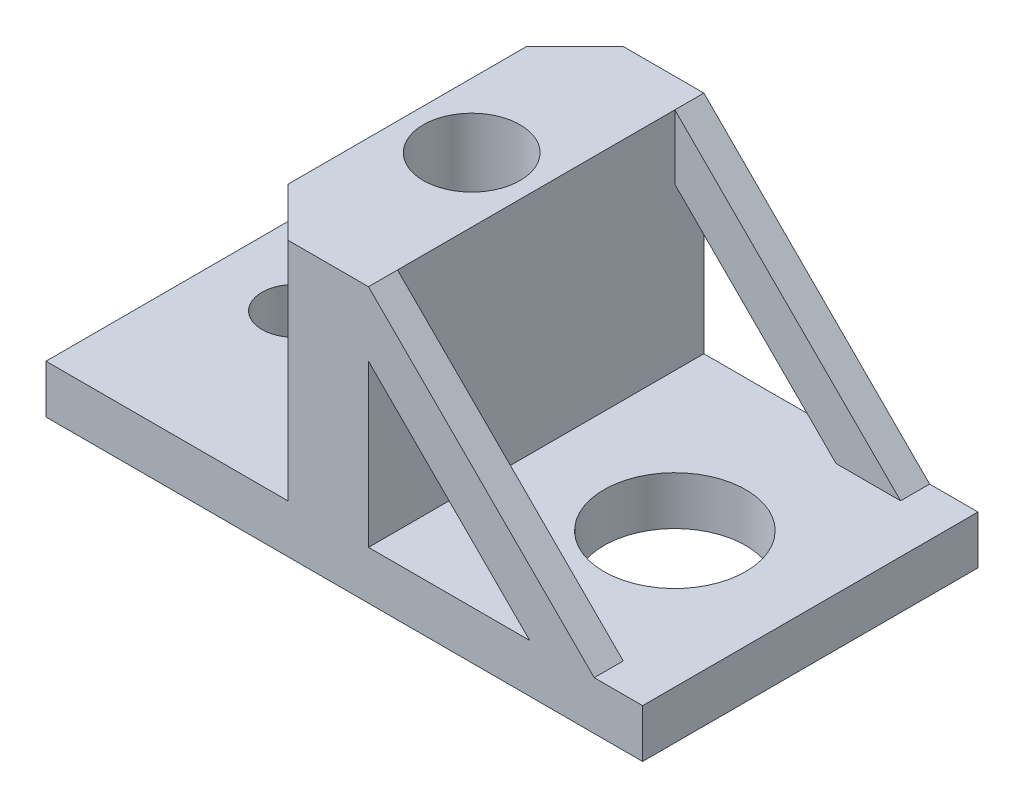
ISO-10303-21;
HEADER;
FILE_DESCRIPTION(('STEP AP214'),'2;1');
FILE_NAME('part.step','',(''),(''),'','','');
FILE_SCHEMA(('AUTOMOTIVE_DESIGN { 1 0 10303 214 1 1 1 1 }'));
ENDSEC;
DATA;
#1=APPLICATION_CONTEXT('core data for automotive mechanical design processes');
#2=APPLICATION_PROTOCOL_DEFINITION('international standard','automotive_design',2000,#1);
#3=PRODUCT_CONTEXT('',#1,'mechanical');
#4=PRODUCT('Part','Part','',(#3));
#5=PRODUCT_RELATED_PRODUCT_CATEGORY('part','',(#4));
#6=PRODUCT_DEFINITION_FORMATION('','',#4);
#7=PRODUCT_DEFINITION_CONTEXT('part definition',#1,'design');
#8=PRODUCT_DEFINITION('design','',#6,#7);
#9=PRODUCT_DEFINITION_SHAPE('','',#8);
#10=(LENGTH_UNIT() NAMED_UNIT(*) SI_UNIT(.MILLI.,.METRE.));
#11=(NAMED_UNIT(*) PLANE_ANGLE_UNIT() SI_UNIT($,.RADIAN.));
#12=(NAMED_UNIT(*) SI_UNIT($,.STERADIAN.) SOLID_ANGLE_UNIT());
#13=UNCERTAINTY_MEASURE_WITH_UNIT(LENGTH_MEASURE(1.E-05),#10,'distance_accuracy_value','');
#14=(GEOMETRIC_REPRESENTATION_CONTEXT(3) GLOBAL_UNCERTAINTY_ASSIGNED_CONTEXT((#13)) GLOBAL_UNIT_ASSIGNED_CONTEXT((#10,
#11,#12)) REPRESENTATION_CONTEXT('',''));
#15=CARTESIAN_POINT('',(0.,0.,0.));
#16=DIRECTION('',(0.,0.,1.));
#17=DIRECTION('',(1.,0.,0.));
#18=AXIS2_PLACEMENT_3D('',#15,#16,#17);
#19=CARTESIAN_POINT('',(0.,7.5,0.));
#20=DIRECTION('',(0.,-1.,0.));
#21=DIRECTION('',(0.,0.,-1.));
#22=AXIS2_PLACEMENT_3D('',#19,#20,#21);
#23=PLANE('',#22);
#24=CARTESIAN_POINT('',(71.5,7.5,-26.));
#25=DIRECTION('',(0.,1.,0.));
#26=DIRECTION('',(0.,0.,1.));
#27=AXIS2_PLACEMENT_3D('',#24,#25,#26);
#28=CIRCLE('',#27,11.);
#29=CARTESIAN_POINT('',(71.5,7.5,-15.));
#30=VERTEX_POINT('',#29);
#31=EDGE_CURVE('E227',#30,#30,#28,.T.);
#32=ORIENTED_EDGE('',*,*,#31,.F.);
#33=EDGE_LOOP('',(#32));
#34=FACE_BOUND('',#33,.T.);
#35=DIRECTION('',(-1.,0.,0.));
#36=VECTOR('',#35,1.);
#37=CARTESIAN_POINT('',(85.,7.5,-47.5));
#38=LINE('',#37,#36);
#39=CARTESIAN_POINT('',(85.,7.5,-47.5));
#40=VERTEX_POINT('',#39);
#41=CARTESIAN_POINT('',(75.,7.5,-47.5));
#42=VERTEX_POINT('',#41);
#43=EDGE_CURVE('E50',#40,#42,#38,.T.);
#44=ORIENTED_EDGE('',*,*,#43,.T.);
#45=DIRECTION('',(0.,0.,-1.));
#46=VECTOR('',#45,1.);
#47=CARTESIAN_POINT('',(75.,7.5,-47.5));
#48=LINE('',#47,#46);
#49=CARTESIAN_POINT('',(75.,7.5,-52.));
#50=VERTEX_POINT('',#49);
#51=EDGE_CURVE('E297',#42,#50,#48,.T.);
#52=ORIENTED_EDGE('',*,*,#51,.T.);
#53=DIRECTION('',(-1.,0.,0.));
#54=VECTOR('',#53,1.);
#55=CARTESIAN_POINT('',(0.,7.5,-52.));
#56=LINE('',#55,#54);
#57=CARTESIAN_POINT('',(50.,7.5,-52.));
#58=VERTEX_POINT('',#57);
#59=EDGE_CURVE('E257',#50,#58,#56,.T.);
#60=ORIENTED_EDGE('',*,*,#59,.T.);
#61=DIRECTION('',(0.,0.,-1.));
#62=VECTOR('',#61,1.);
#63=CARTESIAN_POINT('',(50.,7.5,0.));
#64=LINE('',#63,#62);
#65=CARTESIAN_POINT('',(50.,7.5,0.));
#66=VERTEX_POINT('',#65);
#67=EDGE_CURVE('E208',#66,#58,#64,.T.);
#68=ORIENTED_EDGE('',*,*,#67,.F.);
#69=DIRECTION('',(1.,0.,0.));
#70=VECTOR('',#69,1.);
#71=CARTESIAN_POINT('',(0.,7.5,0.));
#72=LINE('',#71,#70);
#73=CARTESIAN_POINT('',(75.,7.5,0.));
#74=VERTEX_POINT('',#73);
#75=EDGE_CURVE('E251',#66,#74,#72,.T.);
#76=ORIENTED_EDGE('',*,*,#75,.T.);
#77=DIRECTION('',(0.,0.,1.));
#78=VECTOR('',#77,1.);
#79=CARTESIAN_POINT('',(75.,7.5,-4.5));
#80=LINE('',#79,#78);
#81=CARTESIAN_POINT('',(75.,7.5,-4.5));
#82=VERTEX_POINT('',#81);
#83=EDGE_CURVE('E335',#82,#74,#80,.T.);
#84=ORIENTED_EDGE('',*,*,#83,.F.);
#85=DIRECTION('',(1.,0.,0.));
#86=VECTOR('',#85,1.);
#87=CARTESIAN_POINT('',(85.,7.5,-4.5));
#88=LINE('',#87,#86);
#89=CARTESIAN_POINT('',(85.,7.5,-4.5));
#90=VERTEX_POINT('',#89);
#91=EDGE_CURVE('E341',#82,#90,#88,.T.);
#92=ORIENTED_EDGE('',*,*,#91,.T.);
#93=DIRECTION('',(0.,0.,1.));
#94=VECTOR('',#93,1.);
#95=CARTESIAN_POINT('',(85.,7.5,-4.5));
#96=LINE('',#95,#94);
#97=CARTESIAN_POINT('',(85.,7.5,0.));
#98=VERTEX_POINT('',#97);
#99=EDGE_CURVE('E203',#90,#98,#96,.T.);
#100=ORIENTED_EDGE('',*,*,#99,.T.);
#101=CARTESIAN_POINT('',(92.5,7.5,0.));
#102=VERTEX_POINT('',#101);
#103=EDGE_CURVE('E245',#98,#102,#72,.T.);
#104=ORIENTED_EDGE('',*,*,#103,.T.);
#105=DIRECTION('',(0.,0.,-1.));
#106=VECTOR('',#105,1.);
#107=CARTESIAN_POINT('',(92.5,7.5,0.));
#108=LINE('',#107,#106);
#109=CARTESIAN_POINT('',(92.5,7.5,-52.));
#110=VERTEX_POINT('',#109);
#111=EDGE_CURVE('E250',#102,#110,#108,.T.);
#112=ORIENTED_EDGE('',*,*,#111,.T.);
#113=CARTESIAN_POINT('',(85.,7.5,-52.));
#114=VERTEX_POINT('',#113);
#115=EDGE_CURVE('E254',#110,#114,#56,.T.);
#116=ORIENTED_EDGE('',*,*,#115,.T.);
#117=DIRECTION('',(0.,0.,-1.));
#118=VECTOR('',#117,1.);
#119=CARTESIAN_POINT('',(85.,7.5,-47.5));
#120=LINE('',#119,#118);
#121=EDGE_CURVE('E55',#40,#114,#120,.T.);
#122=ORIENTED_EDGE('',*,*,#121,.F.);
#123=EDGE_LOOP('',(#44,#52,#60,#68,#76,#84,#92,#100,#104,#112,#116,#122));
#124=FACE_BOUND('',#123,.T.);
#125=ADVANCED_FACE('F35',(#34,#124),#23,.F.);
#126=DIRECTION('',(0.,0.,-1.));
#127=VECTOR('',#126,1.);
#128=CARTESIAN_POINT('',(30.,7.5,0.));
#129=LINE('',#128,#127);
#130=CARTESIAN_POINT('',(30.,7.5,-7.49999999999999));
#131=VERTEX_POINT('',#130);
#132=CARTESIAN_POINT('',(30.,7.5,-44.5));
#133=VERTEX_POINT('',#132);
#134=EDGE_CURVE('E202',#131,#133,#129,.T.);
#135=ORIENTED_EDGE('',*,*,#134,.T.);
#136=DIRECTION('',(0.707106781186548,0.,-0.707106781186548));
#137=VECTOR('',#136,1.);
#138=CARTESIAN_POINT('',(-7.25,7.5,-7.25));
#139=LINE('',#138,#137);
#140=CARTESIAN_POINT('',(37.5,7.5,-52.));
#141=VERTEX_POINT('',#140);
#142=EDGE_CURVE('E199',#133,#141,#139,.T.);
#143=ORIENTED_EDGE('',*,*,#142,.T.);
#144=CARTESIAN_POINT('',(0.,7.5,-52.));
#145=VERTEX_POINT('',#144);
#146=EDGE_CURVE('E253',#141,#145,#56,.T.);
#147=ORIENTED_EDGE('',*,*,#146,.T.);
#148=DIRECTION('',(0.,0.,1.));
#149=VECTOR('',#148,1.);
#150=CARTESIAN_POINT('',(0.,7.5,0.));
#151=LINE('',#150,#149);
#152=CARTESIAN_POINT('',(0.,7.5,0.));
#153=VERTEX_POINT('',#152);
#154=EDGE_CURVE('E242',#145,#153,#151,.T.);
#155=ORIENTED_EDGE('',*,*,#154,.T.);
#156=CARTESIAN_POINT('',(37.5,7.5,0.));
#157=VERTEX_POINT('',#156);
#158=EDGE_CURVE('E247',#153,#157,#72,.T.);
#159=ORIENTED_EDGE('',*,*,#158,.T.);
#160=DIRECTION('',(0.707106781186548,0.,0.707106781186548));
#161=VECTOR('',#160,1.);
#162=CARTESIAN_POINT('',(18.75,7.5,-18.75));
#163=LINE('',#162,#161);
#164=EDGE_CURVE('E206',#131,#157,#163,.T.);
#165=ORIENTED_EDGE('',*,*,#164,.F.);
#166=EDGE_LOOP('',(#135,#143,#147,#155,#159,#165));
#167=FACE_BOUND('',#166,.T.);
#168=CARTESIAN_POINT('',(12.5,7.5,-26.));
#169=DIRECTION('',(0.,1.,0.));
#170=DIRECTION('',(0.,0.,1.));
#171=AXIS2_PLACEMENT_3D('',#168,#169,#170);
#172=CIRCLE('',#171,5.015);
#173=CARTESIAN_POINT('',(12.5,7.5,-20.985));
#174=VERTEX_POINT('',#173);
#175=EDGE_CURVE('E236',#174,#174,#172,.T.);
#176=ORIENTED_EDGE('',*,*,#175,.F.);
#177=EDGE_LOOP('',(#176));
#178=FACE_BOUND('',#177,.T.);
#179=ADVANCED_FACE('F291',(#167,#178),#23,.F.);
#180=CARTESIAN_POINT('',(0.,0.,0.));
#181=DIRECTION('',(0.,-1.,0.));
#182=DIRECTION('',(0.,0.,-1.));
#183=AXIS2_PLACEMENT_3D('',#180,#181,#182);
#184=PLANE('',#183);
#185=CARTESIAN_POINT('',(40.,0.,-26.));
#186=DIRECTION('',(0.,1.,0.));
#187=DIRECTION('',(0.,0.,1.));
#188=AXIS2_PLACEMENT_3D('',#185,#186,#187);
#189=CIRCLE('',#188,7.5);
#190=CARTESIAN_POINT('',(40.,0.,-18.5));
#191=VERTEX_POINT('',#190);
#192=EDGE_CURVE('E230',#191,#191,#189,.T.);
#193=ORIENTED_EDGE('',*,*,#192,.T.);
#194=EDGE_LOOP('',(#193));
#195=FACE_BOUND('',#194,.T.);
#196=DIRECTION('',(0.,0.,1.));
#197=VECTOR('',#196,1.);
#198=CARTESIAN_POINT('',(0.,0.,0.));
#199=LINE('',#198,#197);
#200=CARTESIAN_POINT('',(0.,0.,-52.));
#201=VERTEX_POINT('',#200);
#202=CARTESIAN_POINT('',(0.,0.,0.));
#203=VERTEX_POINT('',#202);
#204=EDGE_CURVE('E239',#201,#203,#199,.T.);
#205=ORIENTED_EDGE('',*,*,#204,.F.);
#206=DIRECTION('',(-1.,0.,0.));
#207=VECTOR('',#206,1.);
#208=CARTESIAN_POINT('',(0.,0.,-52.));
#209=LINE('',#208,#207);
#210=CARTESIAN_POINT('',(92.5,0.,-52.));
#211=VERTEX_POINT('',#210);
#212=EDGE_CURVE('E246',#211,#201,#209,.T.);
#213=ORIENTED_EDGE('',*,*,#212,.F.);
#214=DIRECTION('',(0.,0.,-1.));
#215=VECTOR('',#214,1.);
#216=CARTESIAN_POINT('',(92.5,0.,0.));
#217=LINE('',#216,#215);
#218=CARTESIAN_POINT('',(92.5,0.,0.));
#219=VERTEX_POINT('',#218);
#220=EDGE_CURVE('E262',#219,#211,#217,.T.);
#221=ORIENTED_EDGE('',*,*,#220,.F.);
#222=DIRECTION('',(1.,0.,0.));
#223=VECTOR('',#222,1.);
#224=CARTESIAN_POINT('',(0.,0.,0.));
#225=LINE('',#224,#223);
#226=EDGE_CURVE('E260',#203,#219,#225,.T.);
#227=ORIENTED_EDGE('',*,*,#226,.F.);
#228=EDGE_LOOP('',(#205,#213,#221,#227));
#229=FACE_BOUND('',#228,.T.);
#230=CARTESIAN_POINT('',(12.5,0.,-26.));
#231=DIRECTION('',(0.,1.,0.));
#232=DIRECTION('',(0.,0.,1.));
#233=AXIS2_PLACEMENT_3D('',#230,#231,#232);
#234=CIRCLE('',#233,5.015);
#235=CARTESIAN_POINT('',(12.5,0.,-20.985));
#236=VERTEX_POINT('',#235);
#237=EDGE_CURVE('E235',#236,#236,#234,.T.);
#238=ORIENTED_EDGE('',*,*,#237,.T.);
#239=EDGE_LOOP('',(#238));
#240=FACE_BOUND('',#239,.T.);
#241=CARTESIAN_POINT('',(71.5,0.,-26.));
#242=DIRECTION('',(0.,1.,0.));
#243=DIRECTION('',(0.,0.,1.));
#244=AXIS2_PLACEMENT_3D('',#241,#242,#243);
#245=CIRCLE('',#244,11.);
#246=CARTESIAN_POINT('',(71.5,0.,-15.));
#247=VERTEX_POINT('',#246);
#248=EDGE_CURVE('E226',#247,#247,#245,.T.);
#249=ORIENTED_EDGE('',*,*,#248,.T.);
#250=EDGE_LOOP('',(#249));
#251=FACE_BOUND('',#250,.T.);
#252=ADVANCED_FACE('F280',(#195,#229,#240,#251),#184,.T.);
#253=CARTESIAN_POINT('',(0.,7.5,0.));
#254=DIRECTION('',(1.,0.,0.));
#255=DIRECTION('',(0.,0.,-1.));
#256=AXIS2_PLACEMENT_3D('',#253,#254,#255);
#257=PLANE('',#256);
#258=ORIENTED_EDGE('',*,*,#204,.T.);
#259=DIRECTION('',(0.,-1.,0.));
#260=VECTOR('',#259,1.);
#261=CARTESIAN_POINT('',(0.,7.5,0.));
#262=LINE('',#261,#260);
#263=EDGE_CURVE('E11',#153,#203,#262,.T.);
#264=ORIENTED_EDGE('',*,*,#263,.F.);
#265=ORIENTED_EDGE('',*,*,#154,.F.);
#266=DIRECTION('',(0.,-1.,0.));
#267=VECTOR('',#266,1.);
#268=CARTESIAN_POINT('',(0.,7.5,-52.));
#269=LINE('',#268,#267);
#270=EDGE_CURVE('E256',#145,#201,#269,.T.);
#271=ORIENTED_EDGE('',*,*,#270,.T.);
#272=EDGE_LOOP('',(#258,#264,#265,#271));
#273=FACE_BOUND('',#272,.T.);
#274=ADVANCED_FACE('F37',(#273),#257,.F.);
#275=CARTESIAN_POINT('',(0.,7.5,0.));
#276=DIRECTION('',(0.,0.,-1.));
#277=DIRECTION('',(-1.,0.,0.));
#278=AXIS2_PLACEMENT_3D('',#275,#276,#277);
#279=PLANE('',#278);
#280=ORIENTED_EDGE('',*,*,#103,.F.);
#281=DIRECTION('',(-0.707106781186548,0.707106781186548,0.));
#282=VECTOR('',#281,1.);
#283=CARTESIAN_POINT('',(50.,42.5,0.));
#284=LINE('',#283,#282);
#285=CARTESIAN_POINT('',(50.,42.5,0.));
#286=VERTEX_POINT('',#285);
#287=EDGE_CURVE('E314',#98,#286,#284,.T.);
#288=ORIENTED_EDGE('',*,*,#287,.T.);
#289=DIRECTION('',(1.,0.,0.));
#290=VECTOR('',#289,1.);
#291=CARTESIAN_POINT('',(0.,42.5,0.));
#292=LINE('',#291,#290);
#293=CARTESIAN_POINT('',(37.5,42.5,0.));
#294=VERTEX_POINT('',#293);
#295=EDGE_CURVE('E187',#294,#286,#292,.T.);
#296=ORIENTED_EDGE('',*,*,#295,.F.);
#297=DIRECTION('',(0.,-1.,0.));
#298=VECTOR('',#297,1.);
#299=CARTESIAN_POINT('',(37.5,42.5,0.));
#300=LINE('',#299,#298);
#301=EDGE_CURVE('E218',#294,#157,#300,.T.);
#302=ORIENTED_EDGE('',*,*,#301,.T.);
#303=ORIENTED_EDGE('',*,*,#158,.F.);
#304=ORIENTED_EDGE('',*,*,#263,.T.);
#305=ORIENTED_EDGE('',*,*,#226,.T.);
#306=DIRECTION('',(0.,-1.,0.));
#307=VECTOR('',#306,1.);
#308=CARTESIAN_POINT('',(92.5,7.5,0.));
#309=LINE('',#308,#307);
#310=EDGE_CURVE('E43',#102,#219,#309,.T.);
#311=ORIENTED_EDGE('',*,*,#310,.F.);
#312=EDGE_LOOP('',(#280,#288,#296,#302,#303,#304,#305,#311));
#313=FACE_BOUND('',#312,.T.);
#314=DIRECTION('',(0.707106781186547,-0.707106781186547,0.));
#315=VECTOR('',#314,1.);
#316=CARTESIAN_POINT('',(75.,7.5,0.));
#317=LINE('',#316,#315);
#318=CARTESIAN_POINT('',(50.,32.5,0.));
#319=VERTEX_POINT('',#318);
#320=EDGE_CURVE('E307',#319,#74,#317,.T.);
#321=ORIENTED_EDGE('',*,*,#320,.T.);
#322=ORIENTED_EDGE('',*,*,#75,.F.);
#323=DIRECTION('',(0.,-1.,0.));
#324=VECTOR('',#323,1.);
#325=CARTESIAN_POINT('',(50.,42.5,0.));
#326=LINE('',#325,#324);
#327=EDGE_CURVE('E216',#319,#66,#326,.T.);
#328=ORIENTED_EDGE('',*,*,#327,.F.);
#329=EDGE_LOOP('',(#321,#322,#328));
#330=FACE_BOUND('',#329,.T.);
#331=ADVANCED_FACE('F306',(#313,#330),#279,.F.);
#332=CARTESIAN_POINT('',(92.5,7.5,0.));
#333=DIRECTION('',(-1.,0.,0.));
#334=DIRECTION('',(0.,0.,1.));
#335=AXIS2_PLACEMENT_3D('',#332,#333,#334);
#336=PLANE('',#335);
#337=ORIENTED_EDGE('',*,*,#220,.T.);
#338=DIRECTION('',(0.,-1.,0.));
#339=VECTOR('',#338,1.);
#340=CARTESIAN_POINT('',(92.5,7.5,-52.));
#341=LINE('',#340,#339);
#342=EDGE_CURVE('E267',#110,#211,#341,.T.);
#343=ORIENTED_EDGE('',*,*,#342,.F.);
#344=ORIENTED_EDGE('',*,*,#111,.F.);
#345=ORIENTED_EDGE('',*,*,#310,.T.);
#346=EDGE_LOOP('',(#337,#343,#344,#345));
#347=FACE_BOUND('',#346,.T.);
#348=ADVANCED_FACE('F274',(#347),#336,.F.);
#349=CARTESIAN_POINT('',(0.,7.5,-52.));
#350=DIRECTION('',(0.,0.,1.));
#351=DIRECTION('',(1.,0.,0.));
#352=AXIS2_PLACEMENT_3D('',#349,#350,#351);
#353=PLANE('',#352);
#354=ORIENTED_EDGE('',*,*,#59,.F.);
#355=DIRECTION('',(-0.707106781186547,0.707106781186548,0.));
#356=VECTOR('',#355,1.);
#357=CARTESIAN_POINT('',(75.,7.5,-52.));
#358=LINE('',#357,#356);
#359=CARTESIAN_POINT('',(50.,32.5,-52.));
#360=VERTEX_POINT('',#359);
#361=EDGE_CURVE('E180',#50,#360,#358,.T.);
#362=ORIENTED_EDGE('',*,*,#361,.T.);
#363=DIRECTION('',(0.,-1.,0.));
#364=VECTOR('',#363,1.);
#365=CARTESIAN_POINT('',(50.,42.5,-52.));
#366=LINE('',#365,#364);
#367=EDGE_CURVE('E213',#360,#58,#366,.T.);
#368=ORIENTED_EDGE('',*,*,#367,.T.);
#369=EDGE_LOOP('',(#354,#362,#368));
#370=FACE_BOUND('',#369,.T.);
#371=ORIENTED_EDGE('',*,*,#212,.T.);
#372=ORIENTED_EDGE('',*,*,#270,.F.);
#373=ORIENTED_EDGE('',*,*,#146,.F.);
#374=DIRECTION('',(0.,-1.,0.));
#375=VECTOR('',#374,1.);
#376=CARTESIAN_POINT('',(37.5,42.5,-52.));
#377=LINE('',#376,#375);
#378=CARTESIAN_POINT('',(37.5,42.5,-52.));
#379=VERTEX_POINT('',#378);
#380=EDGE_CURVE('E198',#379,#141,#377,.T.);
#381=ORIENTED_EDGE('',*,*,#380,.F.);
#382=DIRECTION('',(-1.,0.,0.));
#383=VECTOR('',#382,1.);
#384=CARTESIAN_POINT('',(0.,42.5,-52.));
#385=LINE('',#384,#383);
#386=CARTESIAN_POINT('',(50.,42.5,-52.));
#387=VERTEX_POINT('',#386);
#388=EDGE_CURVE('E189',#387,#379,#385,.T.);
#389=ORIENTED_EDGE('',*,*,#388,.F.);
#390=DIRECTION('',(0.707106781186548,-0.707106781186548,0.));
#391=VECTOR('',#390,1.);
#392=CARTESIAN_POINT('',(50.,42.5,-52.));
#393=LINE('',#392,#391);
#394=EDGE_CURVE('E158',#387,#114,#393,.T.);
#395=ORIENTED_EDGE('',*,*,#394,.T.);
#396=ORIENTED_EDGE('',*,*,#115,.F.);
#397=ORIENTED_EDGE('',*,*,#342,.T.);
#398=EDGE_LOOP('',(#371,#372,#373,#381,#389,#395,#396,#397));
#399=FACE_BOUND('',#398,.T.);
#400=ADVANCED_FACE('F284',(#370,#399),#353,.F.);
#401=CARTESIAN_POINT('',(12.5,7.5,-26.));
#402=DIRECTION('',(0.,-1.,0.));
#403=DIRECTION('',(0.,0.,-1.));
#404=AXIS2_PLACEMENT_3D('',#401,#402,#403);
#405=CYLINDRICAL_SURFACE('',#404,5.015);
#406=ORIENTED_EDGE('',*,*,#175,.T.);
#407=EDGE_LOOP('',(#406));
#408=FACE_BOUND('',#407,.T.);
#409=ORIENTED_EDGE('',*,*,#237,.F.);
#410=EDGE_LOOP('',(#409));
#411=FACE_BOUND('',#410,.T.);
#412=ADVANCED_FACE('F376',(#408,#411),#405,.F.);
#413=CARTESIAN_POINT('',(40.,7.5,-26.));
#414=DIRECTION('',(0.,-1.,0.));
#415=DIRECTION('',(0.,0.,-1.));
#416=AXIS2_PLACEMENT_3D('',#413,#414,#415);
#417=CYLINDRICAL_SURFACE('',#416,7.5);
#418=ORIENTED_EDGE('',*,*,#192,.F.);
#419=EDGE_LOOP('',(#418));
#420=FACE_BOUND('',#419,.T.);
#421=CARTESIAN_POINT('',(40.,42.5,-26.));
#422=DIRECTION('',(0.,1.,0.));
#423=DIRECTION('',(0.,0.,1.));
#424=AXIS2_PLACEMENT_3D('',#421,#422,#423);
#425=CIRCLE('',#424,7.5);
#426=CARTESIAN_POINT('',(40.,42.5,-18.5));
#427=VERTEX_POINT('',#426);
#428=EDGE_CURVE('E195',#427,#427,#425,.F.);
#429=ORIENTED_EDGE('',*,*,#428,.F.);
#430=EDGE_LOOP('',(#429));
#431=FACE_BOUND('',#430,.T.);
#432=ADVANCED_FACE('F410',(#420,#431),#417,.F.);
#433=CARTESIAN_POINT('',(71.5,7.5,-26.));
#434=DIRECTION('',(0.,-1.,0.));
#435=DIRECTION('',(0.,0.,-1.));
#436=AXIS2_PLACEMENT_3D('',#433,#434,#435);
#437=CYLINDRICAL_SURFACE('',#436,11.);
#438=ORIENTED_EDGE('',*,*,#31,.T.);
#439=EDGE_LOOP('',(#438));
#440=FACE_BOUND('',#439,.T.);
#441=ORIENTED_EDGE('',*,*,#248,.F.);
#442=EDGE_LOOP('',(#441));
#443=FACE_BOUND('',#442,.T.);
#444=ADVANCED_FACE('F405',(#440,#443),#437,.F.);
#445=CARTESIAN_POINT('',(-7.25,42.5,-7.25));
#446=DIRECTION('',(-0.707106781186548,0.,-0.707106781186548));
#447=DIRECTION('',(-0.707106781186548,0.,0.707106781186548));
#448=AXIS2_PLACEMENT_3D('',#445,#446,#447);
#449=PLANE('',#448);
#450=ORIENTED_EDGE('',*,*,#142,.F.);
#451=DIRECTION('',(0.,-1.,0.));
#452=VECTOR('',#451,1.);
#453=CARTESIAN_POINT('',(30.,42.5,-44.5));
#454=LINE('',#453,#452);
#455=CARTESIAN_POINT('',(30.,42.5,-44.5));
#456=VERTEX_POINT('',#455);
#457=EDGE_CURVE('E223',#456,#133,#454,.T.);
#458=ORIENTED_EDGE('',*,*,#457,.F.);
#459=DIRECTION('',(0.707106781186548,0.,-0.707106781186548));
#460=VECTOR('',#459,1.);
#461=CARTESIAN_POINT('',(-7.25,42.5,-7.25));
#462=LINE('',#461,#460);
#463=EDGE_CURVE('E211',#456,#379,#462,.T.);
#464=ORIENTED_EDGE('',*,*,#463,.T.);
#465=ORIENTED_EDGE('',*,*,#380,.T.);
#466=EDGE_LOOP('',(#450,#458,#464,#465));
#467=FACE_BOUND('',#466,.T.);
#468=ADVANCED_FACE('F330',(#467),#449,.T.);
#469=CARTESIAN_POINT('',(30.,42.5,0.));
#470=DIRECTION('',(-1.,0.,0.));
#471=DIRECTION('',(0.,0.,1.));
#472=AXIS2_PLACEMENT_3D('',#469,#470,#471);
#473=PLANE('',#472);
#474=ORIENTED_EDGE('',*,*,#134,.F.);
#475=DIRECTION('',(0.,-1.,0.));
#476=VECTOR('',#475,1.);
#477=CARTESIAN_POINT('',(30.,42.5,-7.49999999999999));
#478=LINE('',#477,#476);
#479=CARTESIAN_POINT('',(30.,42.5,-7.49999999999999));
#480=VERTEX_POINT('',#479);
#481=EDGE_CURVE('E221',#480,#131,#478,.T.);
#482=ORIENTED_EDGE('',*,*,#481,.F.);
#483=DIRECTION('',(0.,0.,-1.));
#484=VECTOR('',#483,1.);
#485=CARTESIAN_POINT('',(30.,42.5,0.));
#486=LINE('',#485,#484);
#487=EDGE_CURVE('E322',#480,#456,#486,.T.);
#488=ORIENTED_EDGE('',*,*,#487,.T.);
#489=ORIENTED_EDGE('',*,*,#457,.T.);
#490=EDGE_LOOP('',(#474,#482,#488,#489));
#491=FACE_BOUND('',#490,.T.);
#492=ADVANCED_FACE('F327',(#491),#473,.T.);
#493=CARTESIAN_POINT('',(18.75,42.5,-18.75));
#494=DIRECTION('',(0.707106781186548,0.,-0.707106781186548));
#495=DIRECTION('',(-0.707106781186548,0.,-0.707106781186548));
#496=AXIS2_PLACEMENT_3D('',#493,#494,#495);
#497=PLANE('',#496);
#498=ORIENTED_EDGE('',*,*,#164,.T.);
#499=ORIENTED_EDGE('',*,*,#301,.F.);
#500=DIRECTION('',(0.707106781186548,0.,0.707106781186548));
#501=VECTOR('',#500,1.);
#502=CARTESIAN_POINT('',(18.75,42.5,-18.75));
#503=LINE('',#502,#501);
#504=EDGE_CURVE('E190',#480,#294,#503,.T.);
#505=ORIENTED_EDGE('',*,*,#504,.F.);
#506=ORIENTED_EDGE('',*,*,#481,.T.);
#507=EDGE_LOOP('',(#498,#499,#505,#506));
#508=FACE_BOUND('',#507,.T.);
#509=ADVANCED_FACE('F324',(#508),#497,.F.);
#510=CARTESIAN_POINT('',(50.,42.5,0.));
#511=DIRECTION('',(-1.,0.,0.));
#512=DIRECTION('',(0.,0.,1.));
#513=AXIS2_PLACEMENT_3D('',#510,#511,#512);
#514=PLANE('',#513);
#515=ORIENTED_EDGE('',*,*,#367,.F.);
#516=DIRECTION('',(0.,0.,-1.));
#517=VECTOR('',#516,1.);
#518=CARTESIAN_POINT('',(50.,32.5,-47.5));
#519=LINE('',#518,#517);
#520=CARTESIAN_POINT('',(50.,32.5,-47.5));
#521=VERTEX_POINT('',#520);
#522=EDGE_CURVE('E179',#521,#360,#519,.T.);
#523=ORIENTED_EDGE('',*,*,#522,.F.);
#524=DIRECTION('',(0.,1.,0.));
#525=VECTOR('',#524,1.);
#526=CARTESIAN_POINT('',(50.,32.5,-47.5));
#527=LINE('',#526,#525);
#528=CARTESIAN_POINT('',(50.,42.5,-47.5));
#529=VERTEX_POINT('',#528);
#530=EDGE_CURVE('E168',#521,#529,#527,.T.);
#531=ORIENTED_EDGE('',*,*,#530,.T.);
#532=DIRECTION('',(0.,0.,-1.));
#533=VECTOR('',#532,1.);
#534=CARTESIAN_POINT('',(50.,42.5,0.));
#535=LINE('',#534,#533);
#536=CARTESIAN_POINT('',(50.,42.5,-4.5));
#537=VERTEX_POINT('',#536);
#538=EDGE_CURVE('E177',#537,#529,#535,.T.);
#539=ORIENTED_EDGE('',*,*,#538,.F.);
#540=DIRECTION('',(0.,-1.,0.));
#541=VECTOR('',#540,1.);
#542=CARTESIAN_POINT('',(50.,32.5,-4.5));
#543=LINE('',#542,#541);
#544=CARTESIAN_POINT('',(50.,32.5,-4.5));
#545=VERTEX_POINT('',#544);
#546=EDGE_CURVE('E316',#537,#545,#543,.T.);
#547=ORIENTED_EDGE('',*,*,#546,.T.);
#548=DIRECTION('',(0.,0.,1.));
#549=VECTOR('',#548,1.);
#550=CARTESIAN_POINT('',(50.,32.5,-4.5));
#551=LINE('',#550,#549);
#552=EDGE_CURVE('E303',#545,#319,#551,.T.);
#553=ORIENTED_EDGE('',*,*,#552,.T.);
#554=ORIENTED_EDGE('',*,*,#327,.T.);
#555=ORIENTED_EDGE('',*,*,#67,.T.);
#556=EDGE_LOOP('',(#515,#523,#531,#539,#547,#553,#554,#555));
#557=FACE_BOUND('',#556,.T.);
#558=ADVANCED_FACE('F175',(#557),#514,.F.);
#559=CARTESIAN_POINT('',(0.,42.5,0.));
#560=DIRECTION('',(0.,1.,0.));
#561=DIRECTION('',(0.,0.,1.));
#562=AXIS2_PLACEMENT_3D('',#559,#560,#561);
#563=PLANE('',#562);
#564=ORIENTED_EDGE('',*,*,#463,.F.);
#565=ORIENTED_EDGE('',*,*,#487,.F.);
#566=ORIENTED_EDGE('',*,*,#504,.T.);
#567=ORIENTED_EDGE('',*,*,#295,.T.);
#568=EDGE_CURVE('E186',#286,#537,#535,.T.);
#569=ORIENTED_EDGE('',*,*,#568,.T.);
#570=ORIENTED_EDGE('',*,*,#538,.T.);
#571=DIRECTION('',(0.,0.,-1.));
#572=VECTOR('',#571,1.);
#573=CARTESIAN_POINT('',(50.,42.5,-47.5));
#574=LINE('',#573,#572);
#575=EDGE_CURVE('E153',#529,#387,#574,.T.);
#576=ORIENTED_EDGE('',*,*,#575,.T.);
#577=ORIENTED_EDGE('',*,*,#388,.T.);
#578=EDGE_LOOP('',(#564,#565,#566,#567,#569,#570,#576,#577));
#579=FACE_BOUND('',#578,.T.);
#580=ORIENTED_EDGE('',*,*,#428,.T.);
#581=EDGE_LOOP('',(#580));
#582=FACE_BOUND('',#581,.T.);
#583=ADVANCED_FACE('F183',(#579,#582),#563,.T.);
#584=CARTESIAN_POINT('',(50.,42.5,-4.5));
#585=DIRECTION('',(0.707106781186548,0.707106781186547,0.));
#586=DIRECTION('',(-0.707106781186547,0.707106781186548,0.));
#587=AXIS2_PLACEMENT_3D('',#584,#585,#586);
#588=PLANE('',#587);
#589=ORIENTED_EDGE('',*,*,#287,.F.);
#590=ORIENTED_EDGE('',*,*,#99,.F.);
#591=DIRECTION('',(-0.707106781186548,0.707106781186548,0.));
#592=VECTOR('',#591,1.);
#593=CARTESIAN_POINT('',(50.,42.5,-4.5));
#594=LINE('',#593,#592);
#595=EDGE_CURVE('E336',#90,#537,#594,.T.);
#596=ORIENTED_EDGE('',*,*,#595,.T.);
#597=ORIENTED_EDGE('',*,*,#568,.F.);
#598=EDGE_LOOP('',(#589,#590,#596,#597));
#599=FACE_BOUND('',#598,.T.);
#600=ADVANCED_FACE('F454',(#599),#588,.T.);
#601=CARTESIAN_POINT('',(75.,7.5,-4.5));
#602=DIRECTION('',(-0.707106781186547,-0.707106781186547,0.));
#603=DIRECTION('',(0.707106781186548,-0.707106781186548,0.));
#604=AXIS2_PLACEMENT_3D('',#601,#602,#603);
#605=PLANE('',#604);
#606=ORIENTED_EDGE('',*,*,#320,.F.);
#607=ORIENTED_EDGE('',*,*,#552,.F.);
#608=DIRECTION('',(0.707106781186547,-0.707106781186547,0.));
#609=VECTOR('',#608,1.);
#610=CARTESIAN_POINT('',(75.,7.5,-4.5));
#611=LINE('',#610,#609);
#612=EDGE_CURVE('E343',#545,#82,#611,.T.);
#613=ORIENTED_EDGE('',*,*,#612,.T.);
#614=ORIENTED_EDGE('',*,*,#83,.T.);
#615=EDGE_LOOP('',(#606,#607,#613,#614));
#616=FACE_BOUND('',#615,.T.);
#617=ADVANCED_FACE('F363',(#616),#605,.T.);
#618=CARTESIAN_POINT('',(0.,0.,-4.5));
#619=DIRECTION('',(0.,0.,1.));
#620=DIRECTION('',(1.,0.,0.));
#621=AXIS2_PLACEMENT_3D('',#618,#619,#620);
#622=PLANE('',#621);
#623=ORIENTED_EDGE('',*,*,#546,.F.);
#624=ORIENTED_EDGE('',*,*,#595,.F.);
#625=ORIENTED_EDGE('',*,*,#91,.F.);
#626=ORIENTED_EDGE('',*,*,#612,.F.);
#627=EDGE_LOOP('',(#623,#624,#625,#626));
#628=FACE_BOUND('',#627,.T.);
#629=ADVANCED_FACE('F356',(#628),#622,.F.);
#630=CARTESIAN_POINT('',(75.,7.5,-47.5));
#631=DIRECTION('',(-0.707106781186548,-0.707106781186547,0.));
#632=DIRECTION('',(0.707106781186547,-0.707106781186548,0.));
#633=AXIS2_PLACEMENT_3D('',#630,#631,#632);
#634=PLANE('',#633);
#635=ORIENTED_EDGE('',*,*,#361,.F.);
#636=ORIENTED_EDGE('',*,*,#51,.F.);
#637=DIRECTION('',(-0.707106781186547,0.707106781186548,0.));
#638=VECTOR('',#637,1.);
#639=CARTESIAN_POINT('',(75.,7.5,-47.5));
#640=LINE('',#639,#638);
#641=EDGE_CURVE('E162',#42,#521,#640,.T.);
#642=ORIENTED_EDGE('',*,*,#641,.T.);
#643=ORIENTED_EDGE('',*,*,#522,.T.);
#644=EDGE_LOOP('',(#635,#636,#642,#643));
#645=FACE_BOUND('',#644,.T.);
#646=ADVANCED_FACE('F354',(#645),#634,.T.);
#647=CARTESIAN_POINT('',(50.,42.5,-47.5));
#648=DIRECTION('',(0.707106781186548,0.707106781186547,0.));
#649=DIRECTION('',(-0.707106781186547,0.707106781186548,0.));
#650=AXIS2_PLACEMENT_3D('',#647,#648,#649);
#651=PLANE('',#650);
#652=ORIENTED_EDGE('',*,*,#394,.F.);
#653=ORIENTED_EDGE('',*,*,#575,.F.);
#654=DIRECTION('',(0.707106781186548,-0.707106781186548,0.));
#655=VECTOR('',#654,1.);
#656=CARTESIAN_POINT('',(50.,42.5,-47.5));
#657=LINE('',#656,#655);
#658=EDGE_CURVE('E156',#529,#40,#657,.T.);
#659=ORIENTED_EDGE('',*,*,#658,.T.);
#660=ORIENTED_EDGE('',*,*,#121,.T.);
#661=EDGE_LOOP('',(#652,#653,#659,#660));
#662=FACE_BOUND('',#661,.T.);
#663=ADVANCED_FACE('F155',(#662),#651,.T.);
#664=CARTESIAN_POINT('',(0.,0.,-47.5));
#665=DIRECTION('',(0.,0.,1.));
#666=DIRECTION('',(1.,0.,0.));
#667=AXIS2_PLACEMENT_3D('',#664,#665,#666);
#668=PLANE('',#667);
#669=ORIENTED_EDGE('',*,*,#530,.F.);
#670=ORIENTED_EDGE('',*,*,#641,.F.);
#671=ORIENTED_EDGE('',*,*,#43,.F.);
#672=ORIENTED_EDGE('',*,*,#658,.F.);
#673=EDGE_LOOP('',(#669,#670,#671,#672));
#674=FACE_BOUND('',#673,.T.);
#675=ADVANCED_FACE('F166',(#674),#668,.T.);
#676=CLOSED_SHELL('',(#125,#179,#252,#274,#331,#348,#400,#412,#432,#444,#468,#492,#509,#558,
#583,#600,#617,#629,#646,#663,#675));
#677=MANIFOLD_SOLID_BREP('B2',#676);
#678=ADVANCED_BREP_SHAPE_REPRESENTATION('',(#18,#677),#14);
#679=SHAPE_DEFINITION_REPRESENTATION(#9,#678);
ENDSEC;
END-ISO-10303-21;
